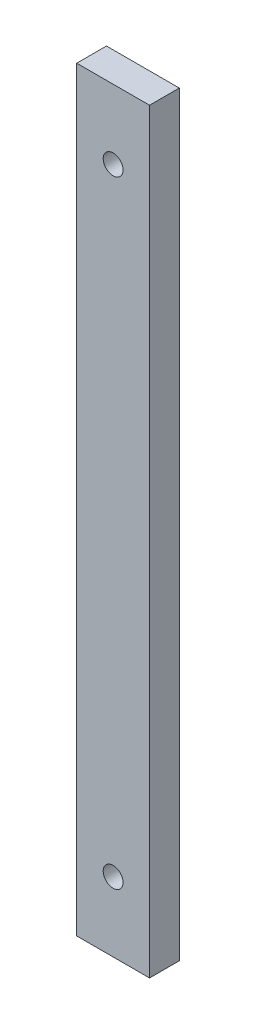
ISO-10303-21;
HEADER;
FILE_DESCRIPTION(('STEP AP214'),'2;1');
FILE_NAME('part.step','',(''),(''),'','','');
FILE_SCHEMA(('AUTOMOTIVE_DESIGN { 1 0 10303 214 1 1 1 1 }'));
ENDSEC;
DATA;
#1=APPLICATION_CONTEXT('core data for automotive mechanical design processes');
#2=APPLICATION_PROTOCOL_DEFINITION('international standard','automotive_design',2000,#1);
#3=PRODUCT_CONTEXT('',#1,'mechanical');
#4=PRODUCT('Part','Part','',(#3));
#5=PRODUCT_RELATED_PRODUCT_CATEGORY('part','',(#4));
#6=PRODUCT_DEFINITION_FORMATION('','',#4);
#7=PRODUCT_DEFINITION_CONTEXT('part definition',#1,'design');
#8=PRODUCT_DEFINITION('design','',#6,#7);
#9=PRODUCT_DEFINITION_SHAPE('','',#8);
#10=(LENGTH_UNIT() NAMED_UNIT(*) SI_UNIT(.MILLI.,.METRE.));
#11=(NAMED_UNIT(*) PLANE_ANGLE_UNIT() SI_UNIT($,.RADIAN.));
#12=(NAMED_UNIT(*) SI_UNIT($,.STERADIAN.) SOLID_ANGLE_UNIT());
#13=UNCERTAINTY_MEASURE_WITH_UNIT(LENGTH_MEASURE(1.E-05),#10,'distance_accuracy_value','');
#14=(GEOMETRIC_REPRESENTATION_CONTEXT(3) GLOBAL_UNCERTAINTY_ASSIGNED_CONTEXT((#13)) GLOBAL_UNIT_ASSIGNED_CONTEXT((#10,
#11,#12)) REPRESENTATION_CONTEXT('',''));
#15=CARTESIAN_POINT('',(0.,0.,0.));
#16=DIRECTION('',(0.,0.,1.));
#17=DIRECTION('',(1.,0.,0.));
#18=AXIS2_PLACEMENT_3D('',#15,#16,#17);
#19=CARTESIAN_POINT('',(0.,0.,6.));
#20=DIRECTION('',(0.,0.,1.));
#21=DIRECTION('',(1.,0.,0.));
#22=AXIS2_PLACEMENT_3D('',#19,#20,#21);
#23=PLANE('',#22);
#24=CARTESIAN_POINT('',(0.,62.2000000000001,6.));
#25=DIRECTION('',(0.,0.,1.));
#26=DIRECTION('',(1.,0.,0.));
#27=AXIS2_PLACEMENT_3D('',#24,#25,#26);
#28=CIRCLE('',#27,2.);
#29=CARTESIAN_POINT('',(2.,62.2000000000001,6.));
#30=VERTEX_POINT('',#29);
#31=EDGE_CURVE('E112',#30,#30,#28,.F.);
#32=ORIENTED_EDGE('',*,*,#31,.T.);
#33=EDGE_LOOP('',(#32));
#34=FACE_BOUND('',#33,.T.);
#35=DIRECTION('',(0.,1.,0.));
#36=VECTOR('',#35,1.);
#37=CARTESIAN_POINT('',(7.33999999999999,76.2,6.));
#38=LINE('',#37,#36);
#39=CARTESIAN_POINT('',(7.34000000000001,-76.2,6.));
#40=VERTEX_POINT('',#39);
#41=CARTESIAN_POINT('',(7.33999999999999,76.2,6.));
#42=VERTEX_POINT('',#41);
#43=EDGE_CURVE('E85',#40,#42,#38,.T.);
#44=ORIENTED_EDGE('',*,*,#43,.T.);
#45=DIRECTION('',(-1.,0.,0.));
#46=VECTOR('',#45,1.);
#47=CARTESIAN_POINT('',(-7.34000000000001,76.2,6.));
#48=LINE('',#47,#46);
#49=CARTESIAN_POINT('',(-7.34000000000001,76.2,6.));
#50=VERTEX_POINT('',#49);
#51=EDGE_CURVE('E80',#42,#50,#48,.T.);
#52=ORIENTED_EDGE('',*,*,#51,.T.);
#53=DIRECTION('',(0.,-1.,0.));
#54=VECTOR('',#53,1.);
#55=CARTESIAN_POINT('',(-7.34000000000001,76.2,6.));
#56=LINE('',#55,#54);
#57=CARTESIAN_POINT('',(-7.33999999999999,-76.2,6.));
#58=VERTEX_POINT('',#57);
#59=EDGE_CURVE('E83',#50,#58,#56,.T.);
#60=ORIENTED_EDGE('',*,*,#59,.T.);
#61=DIRECTION('',(1.,0.,0.));
#62=VECTOR('',#61,1.);
#63=CARTESIAN_POINT('',(-7.33999999999999,-76.2,6.));
#64=LINE('',#63,#62);
#65=EDGE_CURVE('E50',#58,#40,#64,.T.);
#66=ORIENTED_EDGE('',*,*,#65,.T.);
#67=EDGE_LOOP('',(#44,#52,#60,#66));
#68=FACE_BOUND('',#67,.T.);
#69=CARTESIAN_POINT('',(0.,-62.2,6.));
#70=DIRECTION('',(0.,0.,1.));
#71=DIRECTION('',(1.,0.,0.));
#72=AXIS2_PLACEMENT_3D('',#69,#70,#71);
#73=CIRCLE('',#72,2.);
#74=CARTESIAN_POINT('',(2.,-62.2,6.));
#75=VERTEX_POINT('',#74);
#76=EDGE_CURVE('E118',#75,#75,#73,.T.);
#77=ORIENTED_EDGE('',*,*,#76,.F.);
#78=EDGE_LOOP('',(#77));
#79=FACE_BOUND('',#78,.T.);
#80=ADVANCED_FACE('F33',(#34,#68,#79),#23,.T.);
#81=CARTESIAN_POINT('',(0.,0.,0.));
#82=DIRECTION('',(0.,0.,1.));
#83=DIRECTION('',(1.,0.,0.));
#84=AXIS2_PLACEMENT_3D('',#81,#82,#83);
#85=PLANE('',#84);
#86=DIRECTION('',(0.,1.,0.));
#87=VECTOR('',#86,1.);
#88=CARTESIAN_POINT('',(7.33999999999999,76.2,0.));
#89=LINE('',#88,#87);
#90=CARTESIAN_POINT('',(7.34000000000001,-76.2,0.));
#91=VERTEX_POINT('',#90);
#92=CARTESIAN_POINT('',(7.33999999999999,76.2,0.));
#93=VERTEX_POINT('',#92);
#94=EDGE_CURVE('E97',#91,#93,#89,.T.);
#95=ORIENTED_EDGE('',*,*,#94,.F.);
#96=DIRECTION('',(1.,0.,0.));
#97=VECTOR('',#96,1.);
#98=CARTESIAN_POINT('',(-7.33999999999999,-76.2,0.));
#99=LINE('',#98,#97);
#100=CARTESIAN_POINT('',(-7.33999999999999,-76.2,0.));
#101=VERTEX_POINT('',#100);
#102=EDGE_CURVE('E73',#101,#91,#99,.T.);
#103=ORIENTED_EDGE('',*,*,#102,.F.);
#104=DIRECTION('',(0.,-1.,0.));
#105=VECTOR('',#104,1.);
#106=CARTESIAN_POINT('',(-7.34000000000001,76.2,0.));
#107=LINE('',#106,#105);
#108=CARTESIAN_POINT('',(-7.34000000000001,76.2,0.));
#109=VERTEX_POINT('',#108);
#110=EDGE_CURVE('E67',#109,#101,#107,.T.);
#111=ORIENTED_EDGE('',*,*,#110,.F.);
#112=DIRECTION('',(-1.,0.,0.));
#113=VECTOR('',#112,1.);
#114=CARTESIAN_POINT('',(-7.34000000000001,76.2,0.));
#115=LINE('',#114,#113);
#116=EDGE_CURVE('E89',#93,#109,#115,.T.);
#117=ORIENTED_EDGE('',*,*,#116,.F.);
#118=EDGE_LOOP('',(#95,#103,#111,#117));
#119=FACE_BOUND('',#118,.T.);
#120=CARTESIAN_POINT('',(0.,62.2000000000001,0.));
#121=DIRECTION('',(0.,0.,1.));
#122=DIRECTION('',(1.,0.,0.));
#123=AXIS2_PLACEMENT_3D('',#120,#121,#122);
#124=CIRCLE('',#123,2.);
#125=CARTESIAN_POINT('',(2.,62.2000000000001,0.));
#126=VERTEX_POINT('',#125);
#127=EDGE_CURVE('E115',#126,#126,#124,.F.);
#128=ORIENTED_EDGE('',*,*,#127,.F.);
#129=EDGE_LOOP('',(#128));
#130=FACE_BOUND('',#129,.T.);
#131=CARTESIAN_POINT('',(0.,-62.2,0.));
#132=DIRECTION('',(0.,0.,1.));
#133=DIRECTION('',(1.,0.,0.));
#134=AXIS2_PLACEMENT_3D('',#131,#132,#133);
#135=CIRCLE('',#134,2.);
#136=CARTESIAN_POINT('',(2.,-62.2,0.));
#137=VERTEX_POINT('',#136);
#138=EDGE_CURVE('E100',#137,#137,#135,.T.);
#139=ORIENTED_EDGE('',*,*,#138,.T.);
#140=EDGE_LOOP('',(#139));
#141=FACE_BOUND('',#140,.T.);
#142=ADVANCED_FACE('F108',(#119,#130,#141),#85,.F.);
#143=CARTESIAN_POINT('',(7.33999999999999,76.2,6.));
#144=DIRECTION('',(-1.,0.,0.));
#145=DIRECTION('',(0.,-1.,0.));
#146=AXIS2_PLACEMENT_3D('',#143,#144,#145);
#147=PLANE('',#146);
#148=ORIENTED_EDGE('',*,*,#94,.T.);
#149=DIRECTION('',(0.,0.,-1.));
#150=VECTOR('',#149,1.);
#151=CARTESIAN_POINT('',(7.33999999999999,76.2,6.));
#152=LINE('',#151,#150);
#153=EDGE_CURVE('E11',#42,#93,#152,.T.);
#154=ORIENTED_EDGE('',*,*,#153,.F.);
#155=ORIENTED_EDGE('',*,*,#43,.F.);
#156=DIRECTION('',(0.,0.,-1.));
#157=VECTOR('',#156,1.);
#158=CARTESIAN_POINT('',(7.34000000000001,-76.2,6.));
#159=LINE('',#158,#157);
#160=EDGE_CURVE('E93',#40,#91,#159,.T.);
#161=ORIENTED_EDGE('',*,*,#160,.T.);
#162=EDGE_LOOP('',(#148,#154,#155,#161));
#163=FACE_BOUND('',#162,.T.);
#164=ADVANCED_FACE('F35',(#163),#147,.F.);
#165=CARTESIAN_POINT('',(-7.34000000000001,76.2,6.));
#166=DIRECTION('',(0.,-1.,0.));
#167=DIRECTION('',(0.,0.,-1.));
#168=AXIS2_PLACEMENT_3D('',#165,#166,#167);
#169=PLANE('',#168);
#170=ORIENTED_EDGE('',*,*,#116,.T.);
#171=DIRECTION('',(0.,0.,-1.));
#172=VECTOR('',#171,1.);
#173=CARTESIAN_POINT('',(-7.34000000000001,76.2,6.));
#174=LINE('',#173,#172);
#175=EDGE_CURVE('E42',#50,#109,#174,.T.);
#176=ORIENTED_EDGE('',*,*,#175,.F.);
#177=ORIENTED_EDGE('',*,*,#51,.F.);
#178=ORIENTED_EDGE('',*,*,#153,.T.);
#179=EDGE_LOOP('',(#170,#176,#177,#178));
#180=FACE_BOUND('',#179,.T.);
#181=ADVANCED_FACE('F88',(#180),#169,.F.);
#182=CARTESIAN_POINT('',(-7.34000000000001,76.2,6.));
#183=DIRECTION('',(1.,0.,0.));
#184=DIRECTION('',(0.,1.,0.));
#185=AXIS2_PLACEMENT_3D('',#182,#183,#184);
#186=PLANE('',#185);
#187=ORIENTED_EDGE('',*,*,#110,.T.);
#188=DIRECTION('',(0.,0.,-1.));
#189=VECTOR('',#188,1.);
#190=CARTESIAN_POINT('',(-7.33999999999999,-76.2,6.));
#191=LINE('',#190,#189);
#192=EDGE_CURVE('E90',#58,#101,#191,.T.);
#193=ORIENTED_EDGE('',*,*,#192,.F.);
#194=ORIENTED_EDGE('',*,*,#59,.F.);
#195=ORIENTED_EDGE('',*,*,#175,.T.);
#196=EDGE_LOOP('',(#187,#193,#194,#195));
#197=FACE_BOUND('',#196,.T.);
#198=ADVANCED_FACE('F91',(#197),#186,.F.);
#199=CARTESIAN_POINT('',(-7.33999999999999,-76.2,6.));
#200=DIRECTION('',(0.,1.,0.));
#201=DIRECTION('',(0.,0.,1.));
#202=AXIS2_PLACEMENT_3D('',#199,#200,#201);
#203=PLANE('',#202);
#204=ORIENTED_EDGE('',*,*,#102,.T.);
#205=ORIENTED_EDGE('',*,*,#160,.F.);
#206=ORIENTED_EDGE('',*,*,#65,.F.);
#207=ORIENTED_EDGE('',*,*,#192,.T.);
#208=EDGE_LOOP('',(#204,#205,#206,#207));
#209=FACE_BOUND('',#208,.T.);
#210=ADVANCED_FACE('F105',(#209),#203,.F.);
#211=CARTESIAN_POINT('',(0.,62.2000000000001,0.));
#212=DIRECTION('',(0.,0.,1.));
#213=DIRECTION('',(1.,0.,0.));
#214=AXIS2_PLACEMENT_3D('',#211,#212,#213);
#215=CYLINDRICAL_SURFACE('',#214,2.);
#216=ORIENTED_EDGE('',*,*,#127,.T.);
#217=EDGE_LOOP('',(#216));
#218=FACE_BOUND('',#217,.T.);
#219=ORIENTED_EDGE('',*,*,#31,.F.);
#220=EDGE_LOOP('',(#219));
#221=FACE_BOUND('',#220,.T.);
#222=ADVANCED_FACE('F128',(#218,#221),#215,.F.);
#223=CARTESIAN_POINT('',(0.,-62.2,0.));
#224=DIRECTION('',(0.,0.,1.));
#225=DIRECTION('',(1.,0.,0.));
#226=AXIS2_PLACEMENT_3D('',#223,#224,#225);
#227=CYLINDRICAL_SURFACE('',#226,2.);
#228=ORIENTED_EDGE('',*,*,#138,.F.);
#229=EDGE_LOOP('',(#228));
#230=FACE_BOUND('',#229,.T.);
#231=ORIENTED_EDGE('',*,*,#76,.T.);
#232=EDGE_LOOP('',(#231));
#233=FACE_BOUND('',#232,.T.);
#234=ADVANCED_FACE('F125',(#230,#233),#227,.F.);
#235=CLOSED_SHELL('',(#80,#142,#164,#181,#198,#210,#222,#234));
#236=MANIFOLD_SOLID_BREP('B2',#235);
#237=ADVANCED_BREP_SHAPE_REPRESENTATION('',(#18,#236),#14);
#238=SHAPE_DEFINITION_REPRESENTATION(#9,#237);
ENDSEC;
END-ISO-10303-21;
